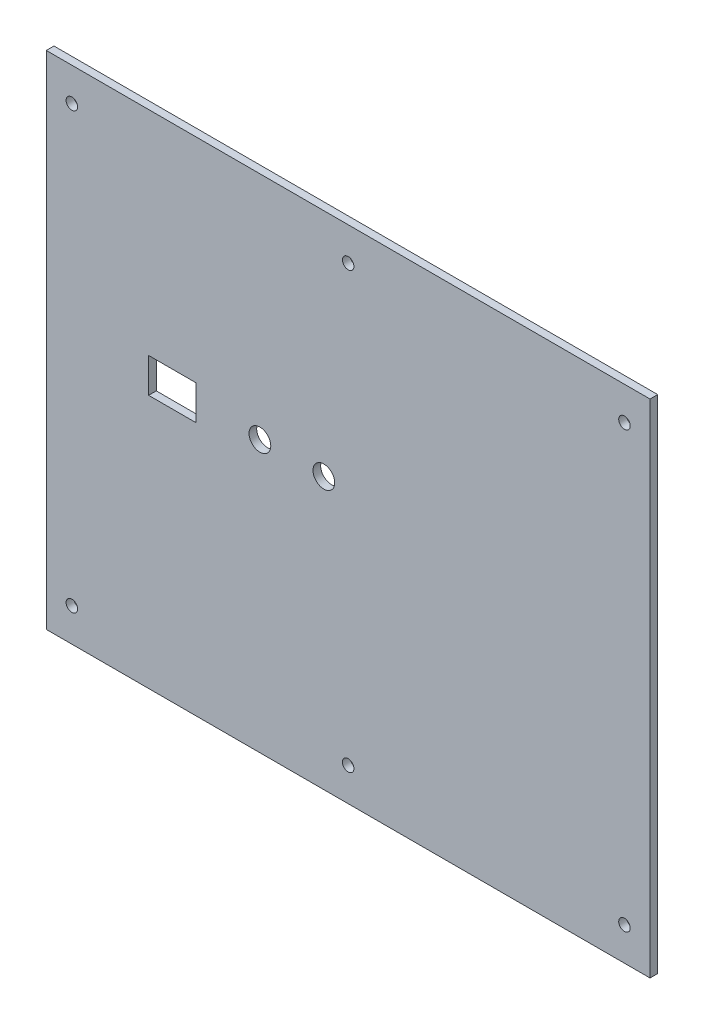
ISO-10303-21;
HEADER;
FILE_DESCRIPTION(('STEP AP214'),'2;1');
FILE_NAME('part.step','',(''),(''),'','','');
FILE_SCHEMA(('AUTOMOTIVE_DESIGN { 1 0 10303 214 1 1 1 1 }'));
ENDSEC;
DATA;
#1=APPLICATION_CONTEXT('core data for automotive mechanical design processes');
#2=APPLICATION_PROTOCOL_DEFINITION('international standard','automotive_design',2000,#1);
#3=PRODUCT_CONTEXT('',#1,'mechanical');
#4=PRODUCT('Part','Part','',(#3));
#5=PRODUCT_RELATED_PRODUCT_CATEGORY('part','',(#4));
#6=PRODUCT_DEFINITION_FORMATION('','',#4);
#7=PRODUCT_DEFINITION_CONTEXT('part definition',#1,'design');
#8=PRODUCT_DEFINITION('design','',#6,#7);
#9=PRODUCT_DEFINITION_SHAPE('','',#8);
#10=(LENGTH_UNIT() NAMED_UNIT(*) SI_UNIT(.MILLI.,.METRE.));
#11=(NAMED_UNIT(*) PLANE_ANGLE_UNIT() SI_UNIT($,.RADIAN.));
#12=(NAMED_UNIT(*) SI_UNIT($,.STERADIAN.) SOLID_ANGLE_UNIT());
#13=UNCERTAINTY_MEASURE_WITH_UNIT(LENGTH_MEASURE(1.E-05),#10,'distance_accuracy_value','');
#14=(GEOMETRIC_REPRESENTATION_CONTEXT(3) GLOBAL_UNCERTAINTY_ASSIGNED_CONTEXT((#13)) GLOBAL_UNIT_ASSIGNED_CONTEXT((#10,
#11,#12)) REPRESENTATION_CONTEXT('',''));
#15=CARTESIAN_POINT('',(0.,0.,0.));
#16=DIRECTION('',(0.,0.,1.));
#17=DIRECTION('',(1.,0.,0.));
#18=AXIS2_PLACEMENT_3D('',#15,#16,#17);
#19=CARTESIAN_POINT('',(0.,0.,3.));
#20=DIRECTION('',(0.,0.,-1.));
#21=DIRECTION('',(-1.,0.,0.));
#22=AXIS2_PLACEMENT_3D('',#19,#20,#21);
#23=PLANE('',#22);
#24=DIRECTION('',(1.,0.,0.));
#25=VECTOR('',#24,1.);
#26=CARTESIAN_POINT('',(40.,99.25,3.));
#27=LINE('',#26,#25);
#28=CARTESIAN_POINT('',(40.,99.25,3.));
#29=VERTEX_POINT('',#28);
#30=CARTESIAN_POINT('',(58.5,99.25,3.));
#31=VERTEX_POINT('',#30);
#32=EDGE_CURVE('E128',#29,#31,#27,.T.);
#33=ORIENTED_EDGE('',*,*,#32,.F.);
#34=DIRECTION('',(0.,-1.,0.));
#35=VECTOR('',#34,1.);
#36=CARTESIAN_POINT('',(40.,112.75,3.));
#37=LINE('',#36,#35);
#38=CARTESIAN_POINT('',(40.,112.75,3.));
#39=VERTEX_POINT('',#38);
#40=EDGE_CURVE('E51',#39,#29,#37,.T.);
#41=ORIENTED_EDGE('',*,*,#40,.F.);
#42=DIRECTION('',(-1.,0.,0.));
#43=VECTOR('',#42,1.);
#44=CARTESIAN_POINT('',(40.,112.75,3.));
#45=LINE('',#44,#43);
#46=CARTESIAN_POINT('',(58.5,112.75,3.));
#47=VERTEX_POINT('',#46);
#48=EDGE_CURVE('E119',#47,#39,#45,.T.);
#49=ORIENTED_EDGE('',*,*,#48,.F.);
#50=DIRECTION('',(0.,1.,0.));
#51=VECTOR('',#50,1.);
#52=CARTESIAN_POINT('',(58.5,112.75,3.));
#53=LINE('',#52,#51);
#54=EDGE_CURVE('E122',#31,#47,#53,.T.);
#55=ORIENTED_EDGE('',*,*,#54,.F.);
#56=EDGE_LOOP('',(#33,#41,#49,#55));
#57=FACE_BOUND('',#56,.T.);
#58=CARTESIAN_POINT('',(83.5,106.,3.));
#59=DIRECTION('',(0.,0.,1.));
#60=DIRECTION('',(1.,0.,0.));
#61=AXIS2_PLACEMENT_3D('',#58,#59,#60);
#62=CIRCLE('',#61,4.25000000000001);
#63=CARTESIAN_POINT('',(87.75,106.,3.));
#64=VERTEX_POINT('',#63);
#65=EDGE_CURVE('E134',#64,#64,#62,.T.);
#66=ORIENTED_EDGE('',*,*,#65,.F.);
#67=EDGE_LOOP('',(#66));
#68=FACE_BOUND('',#67,.T.);
#69=CARTESIAN_POINT('',(108.5,106.,3.));
#70=DIRECTION('',(0.,0.,1.));
#71=DIRECTION('',(1.,0.,0.));
#72=AXIS2_PLACEMENT_3D('',#69,#70,#71);
#73=CIRCLE('',#72,4.25000000000001);
#74=CARTESIAN_POINT('',(112.75,106.,3.));
#75=VERTEX_POINT('',#74);
#76=EDGE_CURVE('E141',#75,#75,#73,.T.);
#77=ORIENTED_EDGE('',*,*,#76,.F.);
#78=EDGE_LOOP('',(#77));
#79=FACE_BOUND('',#78,.T.);
#80=DIRECTION('',(0.,-1.,0.));
#81=VECTOR('',#80,1.);
#82=CARTESIAN_POINT('',(0.,0.,3.));
#83=LINE('',#82,#81);
#84=CARTESIAN_POINT('',(0.,196.,3.));
#85=VERTEX_POINT('',#84);
#86=CARTESIAN_POINT('',(0.,0.,3.));
#87=VERTEX_POINT('',#86);
#88=EDGE_CURVE('E186',#85,#87,#83,.T.);
#89=ORIENTED_EDGE('',*,*,#88,.T.);
#90=DIRECTION('',(1.,0.,0.));
#91=VECTOR('',#90,1.);
#92=CARTESIAN_POINT('',(0.,0.,3.));
#93=LINE('',#92,#91);
#94=CARTESIAN_POINT('',(236.,0.,3.));
#95=VERTEX_POINT('',#94);
#96=EDGE_CURVE('E189',#87,#95,#93,.T.);
#97=ORIENTED_EDGE('',*,*,#96,.T.);
#98=DIRECTION('',(0.,1.,0.));
#99=VECTOR('',#98,1.);
#100=CARTESIAN_POINT('',(236.,0.,3.));
#101=LINE('',#100,#99);
#102=CARTESIAN_POINT('',(236.,196.,3.));
#103=VERTEX_POINT('',#102);
#104=EDGE_CURVE('E192',#95,#103,#101,.T.);
#105=ORIENTED_EDGE('',*,*,#104,.T.);
#106=DIRECTION('',(-1.,0.,0.));
#107=VECTOR('',#106,1.);
#108=CARTESIAN_POINT('',(0.,196.,3.));
#109=LINE('',#108,#107);
#110=EDGE_CURVE('E194',#103,#85,#109,.T.);
#111=ORIENTED_EDGE('',*,*,#110,.T.);
#112=EDGE_LOOP('',(#89,#97,#105,#111));
#113=FACE_BOUND('',#112,.T.);
#114=CARTESIAN_POINT('',(9.99999999999997,183.,3.));
#115=DIRECTION('',(0.,0.,1.));
#116=DIRECTION('',(1.,0.,0.));
#117=AXIS2_PLACEMENT_3D('',#114,#115,#116);
#118=CIRCLE('',#117,2.25);
#119=CARTESIAN_POINT('',(12.25,183.,3.));
#120=VERTEX_POINT('',#119);
#121=EDGE_CURVE('E180',#120,#120,#118,.T.);
#122=ORIENTED_EDGE('',*,*,#121,.F.);
#123=EDGE_LOOP('',(#122));
#124=FACE_BOUND('',#123,.T.);
#125=CARTESIAN_POINT('',(9.99999999999998,13.,3.));
#126=DIRECTION('',(0.,0.,1.));
#127=DIRECTION('',(1.,0.,0.));
#128=AXIS2_PLACEMENT_3D('',#125,#126,#127);
#129=CIRCLE('',#128,2.25);
#130=CARTESIAN_POINT('',(12.25,13.,3.));
#131=VERTEX_POINT('',#130);
#132=EDGE_CURVE('E174',#131,#131,#129,.T.);
#133=ORIENTED_EDGE('',*,*,#132,.F.);
#134=EDGE_LOOP('',(#133));
#135=FACE_BOUND('',#134,.T.);
#136=CARTESIAN_POINT('',(226.,183.,3.));
#137=DIRECTION('',(0.,0.,1.));
#138=DIRECTION('',(1.,0.,0.));
#139=AXIS2_PLACEMENT_3D('',#136,#137,#138);
#140=CIRCLE('',#139,2.25000000000001);
#141=CARTESIAN_POINT('',(228.25,183.,3.));
#142=VERTEX_POINT('',#141);
#143=EDGE_CURVE('E168',#142,#142,#140,.T.);
#144=ORIENTED_EDGE('',*,*,#143,.F.);
#145=EDGE_LOOP('',(#144));
#146=FACE_BOUND('',#145,.T.);
#147=CARTESIAN_POINT('',(226.,13.,3.));
#148=DIRECTION('',(0.,0.,1.));
#149=DIRECTION('',(1.,0.,0.));
#150=AXIS2_PLACEMENT_3D('',#147,#148,#149);
#151=CIRCLE('',#150,2.25000000000001);
#152=CARTESIAN_POINT('',(228.25,13.,3.));
#153=VERTEX_POINT('',#152);
#154=EDGE_CURVE('E162',#153,#153,#151,.T.);
#155=ORIENTED_EDGE('',*,*,#154,.F.);
#156=EDGE_LOOP('',(#155));
#157=FACE_BOUND('',#156,.T.);
#158=CARTESIAN_POINT('',(118.,183.,3.));
#159=DIRECTION('',(0.,0.,1.));
#160=DIRECTION('',(1.,0.,0.));
#161=AXIS2_PLACEMENT_3D('',#158,#159,#160);
#162=CIRCLE('',#161,2.25000000000001);
#163=CARTESIAN_POINT('',(120.25,183.,3.));
#164=VERTEX_POINT('',#163);
#165=EDGE_CURVE('E156',#164,#164,#162,.T.);
#166=ORIENTED_EDGE('',*,*,#165,.F.);
#167=EDGE_LOOP('',(#166));
#168=FACE_BOUND('',#167,.T.);
#169=CARTESIAN_POINT('',(118.,13.,3.));
#170=DIRECTION('',(0.,0.,1.));
#171=DIRECTION('',(1.,0.,0.));
#172=AXIS2_PLACEMENT_3D('',#169,#170,#171);
#173=CIRCLE('',#172,2.25);
#174=CARTESIAN_POINT('',(120.25,13.,3.));
#175=VERTEX_POINT('',#174);
#176=EDGE_CURVE('E150',#175,#175,#173,.T.);
#177=ORIENTED_EDGE('',*,*,#176,.F.);
#178=EDGE_LOOP('',(#177));
#179=FACE_BOUND('',#178,.T.);
#180=ADVANCED_FACE('F36',(#57,#68,#79,#113,#124,#135,#146,#157,#168,#179),#23,.F.);
#181=CARTESIAN_POINT('',(0.,0.,0.));
#182=DIRECTION('',(0.,0.,-1.));
#183=DIRECTION('',(-1.,0.,0.));
#184=AXIS2_PLACEMENT_3D('',#181,#182,#183);
#185=PLANE('',#184);
#186=DIRECTION('',(0.,-1.,0.));
#187=VECTOR('',#186,1.);
#188=CARTESIAN_POINT('',(40.,112.75,0.));
#189=LINE('',#188,#187);
#190=CARTESIAN_POINT('',(40.,112.75,0.));
#191=VERTEX_POINT('',#190);
#192=CARTESIAN_POINT('',(40.,99.25,0.));
#193=VERTEX_POINT('',#192);
#194=EDGE_CURVE('E103',#191,#193,#189,.T.);
#195=ORIENTED_EDGE('',*,*,#194,.T.);
#196=DIRECTION('',(1.,0.,0.));
#197=VECTOR('',#196,1.);
#198=CARTESIAN_POINT('',(40.,99.25,0.));
#199=LINE('',#198,#197);
#200=CARTESIAN_POINT('',(58.5,99.25,0.));
#201=VERTEX_POINT('',#200);
#202=EDGE_CURVE('E112',#193,#201,#199,.T.);
#203=ORIENTED_EDGE('',*,*,#202,.T.);
#204=DIRECTION('',(0.,1.,0.));
#205=VECTOR('',#204,1.);
#206=CARTESIAN_POINT('',(58.5,112.75,0.));
#207=LINE('',#206,#205);
#208=CARTESIAN_POINT('',(58.5,112.75,0.));
#209=VERTEX_POINT('',#208);
#210=EDGE_CURVE('E59',#201,#209,#207,.T.);
#211=ORIENTED_EDGE('',*,*,#210,.T.);
#212=DIRECTION('',(-1.,0.,0.));
#213=VECTOR('',#212,1.);
#214=CARTESIAN_POINT('',(40.,112.75,0.));
#215=LINE('',#214,#213);
#216=EDGE_CURVE('E109',#209,#191,#215,.T.);
#217=ORIENTED_EDGE('',*,*,#216,.T.);
#218=EDGE_LOOP('',(#195,#203,#211,#217));
#219=FACE_BOUND('',#218,.T.);
#220=CARTESIAN_POINT('',(83.5,106.,0.));
#221=DIRECTION('',(0.,0.,1.));
#222=DIRECTION('',(1.,0.,0.));
#223=AXIS2_PLACEMENT_3D('',#220,#221,#222);
#224=CIRCLE('',#223,4.25000000000001);
#225=CARTESIAN_POINT('',(87.75,106.,0.));
#226=VERTEX_POINT('',#225);
#227=EDGE_CURVE('E138',#226,#226,#224,.T.);
#228=ORIENTED_EDGE('',*,*,#227,.T.);
#229=EDGE_LOOP('',(#228));
#230=FACE_BOUND('',#229,.T.);
#231=CARTESIAN_POINT('',(108.5,106.,0.));
#232=DIRECTION('',(0.,0.,1.));
#233=DIRECTION('',(1.,0.,0.));
#234=AXIS2_PLACEMENT_3D('',#231,#232,#233);
#235=CIRCLE('',#234,4.25000000000001);
#236=CARTESIAN_POINT('',(112.75,106.,0.));
#237=VERTEX_POINT('',#236);
#238=EDGE_CURVE('E144',#237,#237,#235,.T.);
#239=ORIENTED_EDGE('',*,*,#238,.T.);
#240=EDGE_LOOP('',(#239));
#241=FACE_BOUND('',#240,.T.);
#242=CARTESIAN_POINT('',(118.,183.,0.));
#243=DIRECTION('',(0.,0.,1.));
#244=DIRECTION('',(1.,0.,0.));
#245=AXIS2_PLACEMENT_3D('',#242,#243,#244);
#246=CIRCLE('',#245,2.25000000000001);
#247=CARTESIAN_POINT('',(120.25,183.,0.));
#248=VERTEX_POINT('',#247);
#249=EDGE_CURVE('E153',#248,#248,#246,.T.);
#250=ORIENTED_EDGE('',*,*,#249,.T.);
#251=EDGE_LOOP('',(#250));
#252=FACE_BOUND('',#251,.T.);
#253=CARTESIAN_POINT('',(226.,183.,0.));
#254=DIRECTION('',(0.,0.,1.));
#255=DIRECTION('',(1.,0.,0.));
#256=AXIS2_PLACEMENT_3D('',#253,#254,#255);
#257=CIRCLE('',#256,2.25000000000001);
#258=CARTESIAN_POINT('',(228.25,183.,0.));
#259=VERTEX_POINT('',#258);
#260=EDGE_CURVE('E165',#259,#259,#257,.T.);
#261=ORIENTED_EDGE('',*,*,#260,.T.);
#262=EDGE_LOOP('',(#261));
#263=FACE_BOUND('',#262,.T.);
#264=CARTESIAN_POINT('',(9.99999999999997,183.,0.));
#265=DIRECTION('',(0.,0.,1.));
#266=DIRECTION('',(1.,0.,0.));
#267=AXIS2_PLACEMENT_3D('',#264,#265,#266);
#268=CIRCLE('',#267,2.25);
#269=CARTESIAN_POINT('',(12.25,183.,0.));
#270=VERTEX_POINT('',#269);
#271=EDGE_CURVE('E177',#270,#270,#268,.T.);
#272=ORIENTED_EDGE('',*,*,#271,.T.);
#273=EDGE_LOOP('',(#272));
#274=FACE_BOUND('',#273,.T.);
#275=DIRECTION('',(0.,-1.,0.));
#276=VECTOR('',#275,1.);
#277=CARTESIAN_POINT('',(0.,0.,0.));
#278=LINE('',#277,#276);
#279=CARTESIAN_POINT('',(0.,196.,0.));
#280=VERTEX_POINT('',#279);
#281=CARTESIAN_POINT('',(0.,0.,0.));
#282=VERTEX_POINT('',#281);
#283=EDGE_CURVE('E183',#280,#282,#278,.T.);
#284=ORIENTED_EDGE('',*,*,#283,.F.);
#285=DIRECTION('',(-1.,0.,0.));
#286=VECTOR('',#285,1.);
#287=CARTESIAN_POINT('',(0.,196.,0.));
#288=LINE('',#287,#286);
#289=CARTESIAN_POINT('',(236.,196.,0.));
#290=VERTEX_POINT('',#289);
#291=EDGE_CURVE('E190',#290,#280,#288,.T.);
#292=ORIENTED_EDGE('',*,*,#291,.F.);
#293=DIRECTION('',(0.,1.,0.));
#294=VECTOR('',#293,1.);
#295=CARTESIAN_POINT('',(236.,0.,0.));
#296=LINE('',#295,#294);
#297=CARTESIAN_POINT('',(236.,0.,0.));
#298=VERTEX_POINT('',#297);
#299=EDGE_CURVE('E201',#298,#290,#296,.T.);
#300=ORIENTED_EDGE('',*,*,#299,.F.);
#301=DIRECTION('',(1.,0.,0.));
#302=VECTOR('',#301,1.);
#303=CARTESIAN_POINT('',(0.,0.,0.));
#304=LINE('',#303,#302);
#305=EDGE_CURVE('E199',#282,#298,#304,.T.);
#306=ORIENTED_EDGE('',*,*,#305,.F.);
#307=EDGE_LOOP('',(#284,#292,#300,#306));
#308=FACE_BOUND('',#307,.T.);
#309=CARTESIAN_POINT('',(9.99999999999998,13.,0.));
#310=DIRECTION('',(0.,0.,1.));
#311=DIRECTION('',(1.,0.,0.));
#312=AXIS2_PLACEMENT_3D('',#309,#310,#311);
#313=CIRCLE('',#312,2.25);
#314=CARTESIAN_POINT('',(12.25,13.,0.));
#315=VERTEX_POINT('',#314);
#316=EDGE_CURVE('E171',#315,#315,#313,.T.);
#317=ORIENTED_EDGE('',*,*,#316,.T.);
#318=EDGE_LOOP('',(#317));
#319=FACE_BOUND('',#318,.T.);
#320=CARTESIAN_POINT('',(226.,13.,0.));
#321=DIRECTION('',(0.,0.,1.));
#322=DIRECTION('',(1.,0.,0.));
#323=AXIS2_PLACEMENT_3D('',#320,#321,#322);
#324=CIRCLE('',#323,2.25000000000001);
#325=CARTESIAN_POINT('',(228.25,13.,0.));
#326=VERTEX_POINT('',#325);
#327=EDGE_CURVE('E159',#326,#326,#324,.T.);
#328=ORIENTED_EDGE('',*,*,#327,.T.);
#329=EDGE_LOOP('',(#328));
#330=FACE_BOUND('',#329,.T.);
#331=CARTESIAN_POINT('',(118.,13.,0.));
#332=DIRECTION('',(0.,0.,1.));
#333=DIRECTION('',(1.,0.,0.));
#334=AXIS2_PLACEMENT_3D('',#331,#332,#333);
#335=CIRCLE('',#334,2.25);
#336=CARTESIAN_POINT('',(120.25,13.,0.));
#337=VERTEX_POINT('',#336);
#338=EDGE_CURVE('E147',#337,#337,#335,.T.);
#339=ORIENTED_EDGE('',*,*,#338,.T.);
#340=EDGE_LOOP('',(#339));
#341=FACE_BOUND('',#340,.T.);
#342=ADVANCED_FACE('F116',(#219,#230,#241,#252,#263,#274,#308,#319,#330,#341),#185,.T.);
#343=CARTESIAN_POINT('',(0.,0.,3.));
#344=DIRECTION('',(1.,0.,0.));
#345=DIRECTION('',(0.,1.,0.));
#346=AXIS2_PLACEMENT_3D('',#343,#344,#345);
#347=PLANE('',#346);
#348=ORIENTED_EDGE('',*,*,#283,.T.);
#349=DIRECTION('',(0.,0.,-1.));
#350=VECTOR('',#349,1.);
#351=CARTESIAN_POINT('',(0.,0.,3.));
#352=LINE('',#351,#350);
#353=EDGE_CURVE('E11',#87,#282,#352,.T.);
#354=ORIENTED_EDGE('',*,*,#353,.F.);
#355=ORIENTED_EDGE('',*,*,#88,.F.);
#356=DIRECTION('',(0.,0.,-1.));
#357=VECTOR('',#356,1.);
#358=CARTESIAN_POINT('',(0.,196.,3.));
#359=LINE('',#358,#357);
#360=EDGE_CURVE('E196',#85,#280,#359,.T.);
#361=ORIENTED_EDGE('',*,*,#360,.T.);
#362=EDGE_LOOP('',(#348,#354,#355,#361));
#363=FACE_BOUND('',#362,.T.);
#364=ADVANCED_FACE('F38',(#363),#347,.F.);
#365=CARTESIAN_POINT('',(0.,0.,3.));
#366=DIRECTION('',(0.,1.,0.));
#367=DIRECTION('',(0.,0.,1.));
#368=AXIS2_PLACEMENT_3D('',#365,#366,#367);
#369=PLANE('',#368);
#370=ORIENTED_EDGE('',*,*,#305,.T.);
#371=DIRECTION('',(0.,0.,-1.));
#372=VECTOR('',#371,1.);
#373=CARTESIAN_POINT('',(236.,0.,3.));
#374=LINE('',#373,#372);
#375=EDGE_CURVE('E44',#95,#298,#374,.T.);
#376=ORIENTED_EDGE('',*,*,#375,.F.);
#377=ORIENTED_EDGE('',*,*,#96,.F.);
#378=ORIENTED_EDGE('',*,*,#353,.T.);
#379=EDGE_LOOP('',(#370,#376,#377,#378));
#380=FACE_BOUND('',#379,.T.);
#381=ADVANCED_FACE('F229',(#380),#369,.F.);
#382=CARTESIAN_POINT('',(236.,0.,3.));
#383=DIRECTION('',(-1.,0.,0.));
#384=DIRECTION('',(0.,-1.,0.));
#385=AXIS2_PLACEMENT_3D('',#382,#383,#384);
#386=PLANE('',#385);
#387=ORIENTED_EDGE('',*,*,#299,.T.);
#388=DIRECTION('',(0.,0.,-1.));
#389=VECTOR('',#388,1.);
#390=CARTESIAN_POINT('',(236.,196.,3.));
#391=LINE('',#390,#389);
#392=EDGE_CURVE('E206',#103,#290,#391,.T.);
#393=ORIENTED_EDGE('',*,*,#392,.F.);
#394=ORIENTED_EDGE('',*,*,#104,.F.);
#395=ORIENTED_EDGE('',*,*,#375,.T.);
#396=EDGE_LOOP('',(#387,#393,#394,#395));
#397=FACE_BOUND('',#396,.T.);
#398=ADVANCED_FACE('F213',(#397),#386,.F.);
#399=CARTESIAN_POINT('',(0.,196.,3.));
#400=DIRECTION('',(0.,-1.,0.));
#401=DIRECTION('',(0.,0.,-1.));
#402=AXIS2_PLACEMENT_3D('',#399,#400,#401);
#403=PLANE('',#402);
#404=ORIENTED_EDGE('',*,*,#291,.T.);
#405=ORIENTED_EDGE('',*,*,#360,.F.);
#406=ORIENTED_EDGE('',*,*,#110,.F.);
#407=ORIENTED_EDGE('',*,*,#392,.T.);
#408=EDGE_LOOP('',(#404,#405,#406,#407));
#409=FACE_BOUND('',#408,.T.);
#410=ADVANCED_FACE('F222',(#409),#403,.F.);
#411=CARTESIAN_POINT('',(9.99999999999997,183.,3.));
#412=DIRECTION('',(0.,0.,-1.));
#413=DIRECTION('',(-1.,0.,0.));
#414=AXIS2_PLACEMENT_3D('',#411,#412,#413);
#415=CYLINDRICAL_SURFACE('',#414,2.25);
#416=ORIENTED_EDGE('',*,*,#121,.T.);
#417=EDGE_LOOP('',(#416));
#418=FACE_BOUND('',#417,.T.);
#419=ORIENTED_EDGE('',*,*,#271,.F.);
#420=EDGE_LOOP('',(#419));
#421=FACE_BOUND('',#420,.T.);
#422=ADVANCED_FACE('F245',(#418,#421),#415,.F.);
#423=CARTESIAN_POINT('',(9.99999999999998,13.,3.));
#424=DIRECTION('',(0.,0.,-1.));
#425=DIRECTION('',(-1.,0.,0.));
#426=AXIS2_PLACEMENT_3D('',#423,#424,#425);
#427=CYLINDRICAL_SURFACE('',#426,2.25);
#428=ORIENTED_EDGE('',*,*,#132,.T.);
#429=EDGE_LOOP('',(#428));
#430=FACE_BOUND('',#429,.T.);
#431=ORIENTED_EDGE('',*,*,#316,.F.);
#432=EDGE_LOOP('',(#431));
#433=FACE_BOUND('',#432,.T.);
#434=ADVANCED_FACE('F252',(#430,#433),#427,.F.);
#435=CARTESIAN_POINT('',(226.,183.,3.));
#436=DIRECTION('',(0.,0.,-1.));
#437=DIRECTION('',(-1.,0.,0.));
#438=AXIS2_PLACEMENT_3D('',#435,#436,#437);
#439=CYLINDRICAL_SURFACE('',#438,2.25000000000001);
#440=ORIENTED_EDGE('',*,*,#143,.T.);
#441=EDGE_LOOP('',(#440));
#442=FACE_BOUND('',#441,.T.);
#443=ORIENTED_EDGE('',*,*,#260,.F.);
#444=EDGE_LOOP('',(#443));
#445=FACE_BOUND('',#444,.T.);
#446=ADVANCED_FACE('F257',(#442,#445),#439,.F.);
#447=CARTESIAN_POINT('',(226.,13.,3.));
#448=DIRECTION('',(0.,0.,-1.));
#449=DIRECTION('',(-1.,0.,0.));
#450=AXIS2_PLACEMENT_3D('',#447,#448,#449);
#451=CYLINDRICAL_SURFACE('',#450,2.25000000000001);
#452=ORIENTED_EDGE('',*,*,#154,.T.);
#453=EDGE_LOOP('',(#452));
#454=FACE_BOUND('',#453,.T.);
#455=ORIENTED_EDGE('',*,*,#327,.F.);
#456=EDGE_LOOP('',(#455));
#457=FACE_BOUND('',#456,.T.);
#458=ADVANCED_FACE('F289',(#454,#457),#451,.F.);
#459=CARTESIAN_POINT('',(118.,183.,3.));
#460=DIRECTION('',(0.,0.,-1.));
#461=DIRECTION('',(-1.,0.,0.));
#462=AXIS2_PLACEMENT_3D('',#459,#460,#461);
#463=CYLINDRICAL_SURFACE('',#462,2.25000000000001);
#464=ORIENTED_EDGE('',*,*,#165,.T.);
#465=EDGE_LOOP('',(#464));
#466=FACE_BOUND('',#465,.T.);
#467=ORIENTED_EDGE('',*,*,#249,.F.);
#468=EDGE_LOOP('',(#467));
#469=FACE_BOUND('',#468,.T.);
#470=ADVANCED_FACE('F278',(#466,#469),#463,.F.);
#471=CARTESIAN_POINT('',(118.,13.,3.));
#472=DIRECTION('',(0.,0.,-1.));
#473=DIRECTION('',(-1.,0.,0.));
#474=AXIS2_PLACEMENT_3D('',#471,#472,#473);
#475=CYLINDRICAL_SURFACE('',#474,2.25);
#476=ORIENTED_EDGE('',*,*,#176,.T.);
#477=EDGE_LOOP('',(#476));
#478=FACE_BOUND('',#477,.T.);
#479=ORIENTED_EDGE('',*,*,#338,.F.);
#480=EDGE_LOOP('',(#479));
#481=FACE_BOUND('',#480,.T.);
#482=ADVANCED_FACE('F274',(#478,#481),#475,.F.);
#483=CARTESIAN_POINT('',(108.5,106.,0.));
#484=DIRECTION('',(0.,0.,1.));
#485=DIRECTION('',(1.,0.,0.));
#486=AXIS2_PLACEMENT_3D('',#483,#484,#485);
#487=CYLINDRICAL_SURFACE('',#486,4.25000000000001);
#488=ORIENTED_EDGE('',*,*,#238,.F.);
#489=EDGE_LOOP('',(#488));
#490=FACE_BOUND('',#489,.T.);
#491=ORIENTED_EDGE('',*,*,#76,.T.);
#492=EDGE_LOOP('',(#491));
#493=FACE_BOUND('',#492,.T.);
#494=ADVANCED_FACE('F277',(#490,#493),#487,.F.);
#495=CARTESIAN_POINT('',(83.5,106.,0.));
#496=DIRECTION('',(0.,0.,1.));
#497=DIRECTION('',(1.,0.,0.));
#498=AXIS2_PLACEMENT_3D('',#495,#496,#497);
#499=CYLINDRICAL_SURFACE('',#498,4.25000000000001);
#500=ORIENTED_EDGE('',*,*,#227,.F.);
#501=EDGE_LOOP('',(#500));
#502=FACE_BOUND('',#501,.T.);
#503=ORIENTED_EDGE('',*,*,#65,.T.);
#504=EDGE_LOOP('',(#503));
#505=FACE_BOUND('',#504,.T.);
#506=ADVANCED_FACE('F286',(#502,#505),#499,.F.);
#507=CARTESIAN_POINT('',(40.,112.75,0.));
#508=DIRECTION('',(-1.,0.,0.));
#509=DIRECTION('',(0.,0.,1.));
#510=AXIS2_PLACEMENT_3D('',#507,#508,#509);
#511=PLANE('',#510);
#512=ORIENTED_EDGE('',*,*,#40,.T.);
#513=DIRECTION('',(0.,0.,1.));
#514=VECTOR('',#513,1.);
#515=CARTESIAN_POINT('',(40.,99.25,0.));
#516=LINE('',#515,#514);
#517=EDGE_CURVE('E99',#193,#29,#516,.T.);
#518=ORIENTED_EDGE('',*,*,#517,.F.);
#519=ORIENTED_EDGE('',*,*,#194,.F.);
#520=DIRECTION('',(0.,0.,1.));
#521=VECTOR('',#520,1.);
#522=CARTESIAN_POINT('',(40.,112.75,0.));
#523=LINE('',#522,#521);
#524=EDGE_CURVE('E132',#191,#39,#523,.T.);
#525=ORIENTED_EDGE('',*,*,#524,.T.);
#526=EDGE_LOOP('',(#512,#518,#519,#525));
#527=FACE_BOUND('',#526,.T.);
#528=ADVANCED_FACE('F101',(#527),#511,.F.);
#529=CARTESIAN_POINT('',(40.,112.75,0.));
#530=DIRECTION('',(0.,1.,0.));
#531=DIRECTION('',(0.,0.,1.));
#532=AXIS2_PLACEMENT_3D('',#529,#530,#531);
#533=PLANE('',#532);
#534=ORIENTED_EDGE('',*,*,#48,.T.);
#535=ORIENTED_EDGE('',*,*,#524,.F.);
#536=ORIENTED_EDGE('',*,*,#216,.F.);
#537=DIRECTION('',(0.,0.,1.));
#538=VECTOR('',#537,1.);
#539=CARTESIAN_POINT('',(58.5,112.75,0.));
#540=LINE('',#539,#538);
#541=EDGE_CURVE('E135',#209,#47,#540,.T.);
#542=ORIENTED_EDGE('',*,*,#541,.T.);
#543=EDGE_LOOP('',(#534,#535,#536,#542));
#544=FACE_BOUND('',#543,.T.);
#545=ADVANCED_FACE('F352',(#544),#533,.F.);
#546=CARTESIAN_POINT('',(58.5,112.75,0.));
#547=DIRECTION('',(1.,0.,0.));
#548=DIRECTION('',(0.,0.,-1.));
#549=AXIS2_PLACEMENT_3D('',#546,#547,#548);
#550=PLANE('',#549);
#551=ORIENTED_EDGE('',*,*,#54,.T.);
#552=ORIENTED_EDGE('',*,*,#541,.F.);
#553=ORIENTED_EDGE('',*,*,#210,.F.);
#554=DIRECTION('',(0.,0.,1.));
#555=VECTOR('',#554,1.);
#556=CARTESIAN_POINT('',(58.5,99.25,0.));
#557=LINE('',#556,#555);
#558=EDGE_CURVE('E108',#201,#31,#557,.T.);
#559=ORIENTED_EDGE('',*,*,#558,.T.);
#560=EDGE_LOOP('',(#551,#552,#553,#559));
#561=FACE_BOUND('',#560,.T.);
#562=ADVANCED_FACE('F361',(#561),#550,.F.);
#563=CARTESIAN_POINT('',(40.,99.25,0.));
#564=DIRECTION('',(0.,-1.,0.));
#565=DIRECTION('',(0.,0.,-1.));
#566=AXIS2_PLACEMENT_3D('',#563,#564,#565);
#567=PLANE('',#566);
#568=ORIENTED_EDGE('',*,*,#32,.T.);
#569=ORIENTED_EDGE('',*,*,#558,.F.);
#570=ORIENTED_EDGE('',*,*,#202,.F.);
#571=ORIENTED_EDGE('',*,*,#517,.T.);
#572=EDGE_LOOP('',(#568,#569,#570,#571));
#573=FACE_BOUND('',#572,.T.);
#574=ADVANCED_FACE('F113',(#573),#567,.F.);
#575=CLOSED_SHELL('',(#180,#342,#364,#381,#398,#410,#422,#434,#446,#458,#470,#482,#494,#506,
#528,#545,#562,#574));
#576=MANIFOLD_SOLID_BREP('B2',#575);
#577=ADVANCED_BREP_SHAPE_REPRESENTATION('',(#18,#576),#14);
#578=SHAPE_DEFINITION_REPRESENTATION(#9,#577);
ENDSEC;
END-ISO-10303-21;
